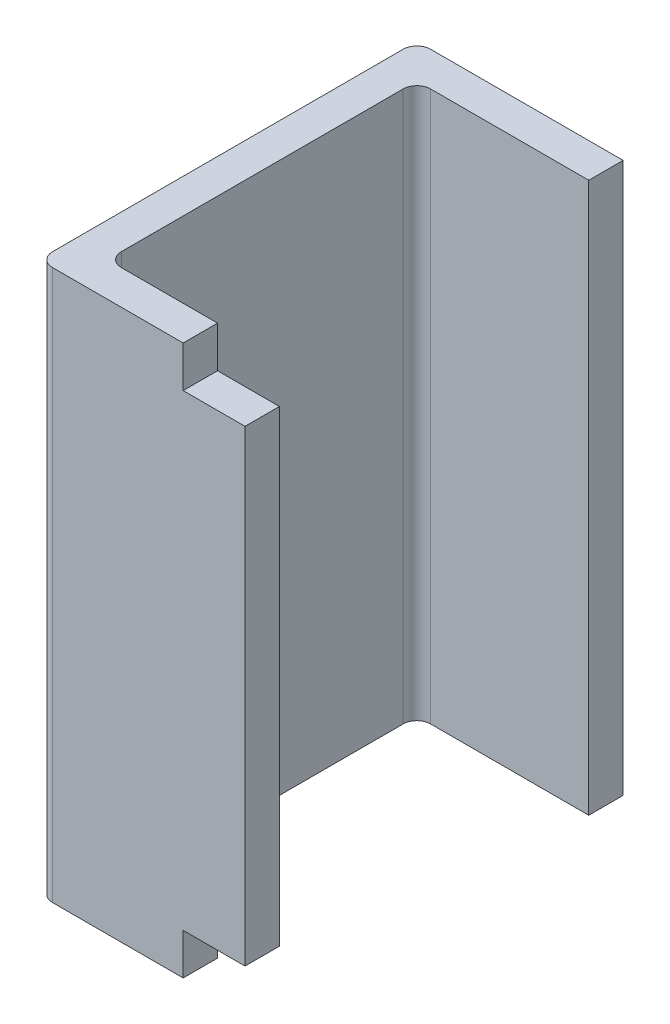
ISO-10303-21;
HEADER;
FILE_DESCRIPTION(('STEP AP214'),'2;1');
FILE_NAME('part.step','',(''),(''),'','','');
FILE_SCHEMA(('AUTOMOTIVE_DESIGN { 1 0 10303 214 1 1 1 1 }'));
ENDSEC;
DATA;
#1=APPLICATION_CONTEXT('core data for automotive mechanical design processes');
#2=APPLICATION_PROTOCOL_DEFINITION('international standard','automotive_design',2000,#1);
#3=PRODUCT_CONTEXT('',#1,'mechanical');
#4=PRODUCT('Part','Part','',(#3));
#5=PRODUCT_RELATED_PRODUCT_CATEGORY('part','',(#4));
#6=PRODUCT_DEFINITION_FORMATION('','',#4);
#7=PRODUCT_DEFINITION_CONTEXT('part definition',#1,'design');
#8=PRODUCT_DEFINITION('design','',#6,#7);
#9=PRODUCT_DEFINITION_SHAPE('','',#8);
#10=(LENGTH_UNIT() NAMED_UNIT(*) SI_UNIT(.MILLI.,.METRE.));
#11=(NAMED_UNIT(*) PLANE_ANGLE_UNIT() SI_UNIT($,.RADIAN.));
#12=(NAMED_UNIT(*) SI_UNIT($,.STERADIAN.) SOLID_ANGLE_UNIT());
#13=UNCERTAINTY_MEASURE_WITH_UNIT(LENGTH_MEASURE(1.E-05),#10,'distance_accuracy_value','');
#14=(GEOMETRIC_REPRESENTATION_CONTEXT(3) GLOBAL_UNCERTAINTY_ASSIGNED_CONTEXT((#13)) GLOBAL_UNIT_ASSIGNED_CONTEXT((#10,
#11,#12)) REPRESENTATION_CONTEXT('',''));
#15=CARTESIAN_POINT('',(0.,0.,0.));
#16=DIRECTION('',(0.,0.,1.));
#17=DIRECTION('',(1.,0.,0.));
#18=AXIS2_PLACEMENT_3D('',#15,#16,#17);
#19=CARTESIAN_POINT('',(-0.565,-0.34,0.55));
#20=DIRECTION('',(0.,1.,0.));
#21=DIRECTION('',(0.,0.,1.));
#22=AXIS2_PLACEMENT_3D('',#19,#20,#21);
#23=PLANE('',#22);
#24=DIRECTION('',(0.,0.,1.));
#25=VECTOR('',#24,1.);
#26=CARTESIAN_POINT('',(-0.475,-0.34,0.45));
#27=LINE('',#26,#25);
#28=CARTESIAN_POINT('',(-0.475,-0.34,0.5));
#29=VERTEX_POINT('',#28);
#30=CARTESIAN_POINT('',(-0.475,-0.34,0.55));
#31=VERTEX_POINT('',#30);
#32=EDGE_CURVE('E210',#29,#31,#27,.T.);
#33=ORIENTED_EDGE('',*,*,#32,.T.);
#34=DIRECTION('',(1.,0.,0.));
#35=VECTOR('',#34,1.);
#36=CARTESIAN_POINT('',(0.,-0.34,0.55));
#37=LINE('',#36,#35);
#38=CARTESIAN_POINT('',(-0.565,-0.34,0.55));
#39=VERTEX_POINT('',#38);
#40=EDGE_CURVE('E129',#39,#31,#37,.T.);
#41=ORIENTED_EDGE('',*,*,#40,.F.);
#42=DIRECTION('',(0.,0.,1.));
#43=VECTOR('',#42,1.);
#44=CARTESIAN_POINT('',(-0.565,-0.34,0.55));
#45=LINE('',#44,#43);
#46=CARTESIAN_POINT('',(-0.565,-0.34,0.5));
#47=VERTEX_POINT('',#46);
#48=EDGE_CURVE('E140',#39,#47,#45,.F.);
#49=ORIENTED_EDGE('',*,*,#48,.T.);
#50=DIRECTION('',(1.,0.,0.));
#51=VECTOR('',#50,1.);
#52=CARTESIAN_POINT('',(-0.725,-0.34,0.5));
#53=LINE('',#52,#51);
#54=EDGE_CURVE('E150',#47,#29,#53,.T.);
#55=ORIENTED_EDGE('',*,*,#54,.T.);
#56=EDGE_LOOP('',(#33,#41,#49,#55));
#57=FACE_BOUND('',#56,.T.);
#58=ADVANCED_FACE('F17',(#57),#23,.F.);
#59=CARTESIAN_POINT('',(-0.475,0.4,0.45));
#60=DIRECTION('',(-1.,0.,0.));
#61=DIRECTION('',(0.,0.,1.));
#62=AXIS2_PLACEMENT_3D('',#59,#60,#61);
#63=PLANE('',#62);
#64=DIRECTION('',(0.,1.,0.));
#65=VECTOR('',#64,1.);
#66=CARTESIAN_POINT('',(-0.475,0.4,0.5));
#67=LINE('',#66,#65);
#68=CARTESIAN_POINT('',(-0.475,0.34,0.5));
#69=VERTEX_POINT('',#68);
#70=EDGE_CURVE('E231',#29,#69,#67,.T.);
#71=ORIENTED_EDGE('',*,*,#70,.T.);
#72=DIRECTION('',(0.,0.,-1.));
#73=VECTOR('',#72,1.);
#74=CARTESIAN_POINT('',(-0.475,0.34,0.55));
#75=LINE('',#74,#73);
#76=CARTESIAN_POINT('',(-0.475,0.34,0.55));
#77=VERTEX_POINT('',#76);
#78=EDGE_CURVE('E200',#69,#77,#75,.F.);
#79=ORIENTED_EDGE('',*,*,#78,.T.);
#80=DIRECTION('',(0.,1.,0.));
#81=VECTOR('',#80,1.);
#82=CARTESIAN_POINT('',(-0.475,0.,0.55));
#83=LINE('',#82,#81);
#84=EDGE_CURVE('E205',#31,#77,#83,.T.);
#85=ORIENTED_EDGE('',*,*,#84,.F.);
#86=ORIENTED_EDGE('',*,*,#32,.F.);
#87=EDGE_LOOP('',(#71,#79,#85,#86));
#88=FACE_BOUND('',#87,.T.);
#89=ADVANCED_FACE('F342',(#88),#63,.F.);
#90=CARTESIAN_POINT('',(-0.475,0.34,0.55));
#91=DIRECTION('',(0.,-1.,0.));
#92=DIRECTION('',(0.,0.,-1.));
#93=AXIS2_PLACEMENT_3D('',#90,#91,#92);
#94=PLANE('',#93);
#95=DIRECTION('',(0.,0.,1.));
#96=VECTOR('',#95,1.);
#97=CARTESIAN_POINT('',(-0.565,0.34,0.55));
#98=LINE('',#97,#96);
#99=CARTESIAN_POINT('',(-0.565,0.34,0.5));
#100=VERTEX_POINT('',#99);
#101=CARTESIAN_POINT('',(-0.565,0.34,0.55));
#102=VERTEX_POINT('',#101);
#103=EDGE_CURVE('E172',#100,#102,#98,.T.);
#104=ORIENTED_EDGE('',*,*,#103,.T.);
#105=DIRECTION('',(1.,0.,0.));
#106=VECTOR('',#105,1.);
#107=CARTESIAN_POINT('',(0.,0.34,0.55));
#108=LINE('',#107,#106);
#109=EDGE_CURVE('E195',#77,#102,#108,.F.);
#110=ORIENTED_EDGE('',*,*,#109,.F.);
#111=ORIENTED_EDGE('',*,*,#78,.F.);
#112=DIRECTION('',(1.,0.,0.));
#113=VECTOR('',#112,1.);
#114=CARTESIAN_POINT('',(-0.725,0.34,0.5));
#115=LINE('',#114,#113);
#116=EDGE_CURVE('E186',#69,#100,#115,.F.);
#117=ORIENTED_EDGE('',*,*,#116,.T.);
#118=EDGE_LOOP('',(#104,#110,#111,#117));
#119=FACE_BOUND('',#118,.T.);
#120=ADVANCED_FACE('F348',(#119),#94,.F.);
#121=CARTESIAN_POINT('',(-0.565,0.34,0.55));
#122=DIRECTION('',(-1.,0.,0.));
#123=DIRECTION('',(0.,0.,1.));
#124=AXIS2_PLACEMENT_3D('',#121,#122,#123);
#125=PLANE('',#124);
#126=DIRECTION('',(0.,0.,1.));
#127=VECTOR('',#126,1.);
#128=CARTESIAN_POINT('',(-0.565,0.4,0.));
#129=LINE('',#128,#127);
#130=CARTESIAN_POINT('',(-0.565,0.4,0.55));
#131=VERTEX_POINT('',#130);
#132=CARTESIAN_POINT('',(-0.565,0.4,0.5));
#133=VERTEX_POINT('',#132);
#134=EDGE_CURVE('E120',#131,#133,#129,.F.);
#135=ORIENTED_EDGE('',*,*,#134,.F.);
#136=DIRECTION('',(0.,1.,0.));
#137=VECTOR('',#136,1.);
#138=CARTESIAN_POINT('',(-0.565,0.,0.55));
#139=LINE('',#138,#137);
#140=EDGE_CURVE('E179',#102,#131,#139,.T.);
#141=ORIENTED_EDGE('',*,*,#140,.F.);
#142=ORIENTED_EDGE('',*,*,#103,.F.);
#143=DIRECTION('',(0.,1.,0.));
#144=VECTOR('',#143,1.);
#145=CARTESIAN_POINT('',(-0.565,0.4,0.5));
#146=LINE('',#145,#144);
#147=EDGE_CURVE('E146',#100,#133,#146,.T.);
#148=ORIENTED_EDGE('',*,*,#147,.T.);
#149=EDGE_LOOP('',(#135,#141,#142,#148));
#150=FACE_BOUND('',#149,.T.);
#151=ADVANCED_FACE('F353',(#150),#125,.F.);
#152=CARTESIAN_POINT('',(0.,0.,0.));
#153=DIRECTION('',(0.,0.,1.));
#154=DIRECTION('',(1.,0.,0.));
#155=AXIS2_PLACEMENT_3D('',#152,#153,#154);
#156=PLANE('',#155);
#157=DIRECTION('',(1.,0.,0.));
#158=VECTOR('',#157,1.);
#159=CARTESIAN_POINT('',(0.775,0.4,0.));
#160=LINE('',#159,#158);
#161=CARTESIAN_POINT('',(-0.475,0.4,0.));
#162=VERTEX_POINT('',#161);
#163=CARTESIAN_POINT('',(-0.755,0.4,0.));
#164=VERTEX_POINT('',#163);
#165=EDGE_CURVE('E102',#162,#164,#160,.F.);
#166=ORIENTED_EDGE('',*,*,#165,.F.);
#167=DIRECTION('',(0.,1.,0.));
#168=VECTOR('',#167,1.);
#169=CARTESIAN_POINT('',(-0.475,0.4,0.));
#170=LINE('',#169,#168);
#171=CARTESIAN_POINT('',(-0.475,-0.4,0.));
#172=VERTEX_POINT('',#171);
#173=EDGE_CURVE('E160',#162,#172,#170,.F.);
#174=ORIENTED_EDGE('',*,*,#173,.T.);
#175=DIRECTION('',(1.,0.,0.));
#176=VECTOR('',#175,1.);
#177=CARTESIAN_POINT('',(-0.775,-0.4,0.));
#178=LINE('',#177,#176);
#179=CARTESIAN_POINT('',(-0.755,-0.4,0.));
#180=VERTEX_POINT('',#179);
#181=EDGE_CURVE('E167',#180,#172,#178,.T.);
#182=ORIENTED_EDGE('',*,*,#181,.F.);
#183=DIRECTION('',(0.,-1.,0.));
#184=VECTOR('',#183,1.);
#185=CARTESIAN_POINT('',(-0.755,0.2,0.));
#186=LINE('',#185,#184);
#187=EDGE_CURVE('E175',#164,#180,#186,.T.);
#188=ORIENTED_EDGE('',*,*,#187,.F.);
#189=EDGE_LOOP('',(#166,#174,#182,#188));
#190=FACE_BOUND('',#189,.T.);
#191=ADVANCED_FACE('F291',(#190),#156,.F.);
#192=CARTESIAN_POINT('',(-0.475,0.4,-0.03709742412571));
#193=DIRECTION('',(-1.,0.,0.));
#194=DIRECTION('',(0.,0.,1.));
#195=AXIS2_PLACEMENT_3D('',#192,#193,#194);
#196=PLANE('',#195);
#197=ORIENTED_EDGE('',*,*,#173,.F.);
#198=DIRECTION('',(0.,0.,1.));
#199=VECTOR('',#198,1.);
#200=CARTESIAN_POINT('',(-0.475,0.4,0.));
#201=LINE('',#200,#199);
#202=CARTESIAN_POINT('',(-0.475,0.4,0.05));
#203=VERTEX_POINT('',#202);
#204=EDGE_CURVE('E104',#203,#162,#201,.F.);
#205=ORIENTED_EDGE('',*,*,#204,.F.);
#206=DIRECTION('',(0.,1.,0.));
#207=VECTOR('',#206,1.);
#208=CARTESIAN_POINT('',(-0.475,0.4,0.05));
#209=LINE('',#208,#207);
#210=CARTESIAN_POINT('',(-0.475,-0.4,0.05));
#211=VERTEX_POINT('',#210);
#212=EDGE_CURVE('E157',#203,#211,#209,.F.);
#213=ORIENTED_EDGE('',*,*,#212,.T.);
#214=DIRECTION('',(0.,0.,-1.));
#215=VECTOR('',#214,1.);
#216=CARTESIAN_POINT('',(-0.475,-0.4,0.));
#217=LINE('',#216,#215);
#218=EDGE_CURVE('E163',#172,#211,#217,.F.);
#219=ORIENTED_EDGE('',*,*,#218,.F.);
#220=EDGE_LOOP('',(#197,#205,#213,#219));
#221=FACE_BOUND('',#220,.T.);
#222=ADVANCED_FACE('F284',(#221),#196,.F.);
#223=CARTESIAN_POINT('',(0.725,0.4,0.05));
#224=DIRECTION('',(0.,0.,-1.));
#225=DIRECTION('',(-1.,0.,0.));
#226=AXIS2_PLACEMENT_3D('',#223,#224,#225);
#227=PLANE('',#226);
#228=DIRECTION('',(1.,0.,0.));
#229=VECTOR('',#228,1.);
#230=CARTESIAN_POINT('',(-0.775,-0.4,0.05));
#231=LINE('',#230,#229);
#232=CARTESIAN_POINT('',(-0.705,-0.4,0.05));
#233=VERTEX_POINT('',#232);
#234=EDGE_CURVE('E166',#211,#233,#231,.F.);
#235=ORIENTED_EDGE('',*,*,#234,.F.);
#236=ORIENTED_EDGE('',*,*,#212,.F.);
#237=DIRECTION('',(1.,0.,0.));
#238=VECTOR('',#237,1.);
#239=CARTESIAN_POINT('',(0.775,0.4,0.05));
#240=LINE('',#239,#238);
#241=CARTESIAN_POINT('',(-0.705,0.4,0.05));
#242=VERTEX_POINT('',#241);
#243=EDGE_CURVE('E107',#242,#203,#240,.T.);
#244=ORIENTED_EDGE('',*,*,#243,.F.);
#245=DIRECTION('',(0.,1.,0.));
#246=VECTOR('',#245,1.);
#247=CARTESIAN_POINT('',(-0.705,0.4,0.05));
#248=LINE('',#247,#246);
#249=EDGE_CURVE('E154',#242,#233,#248,.F.);
#250=ORIENTED_EDGE('',*,*,#249,.T.);
#251=EDGE_LOOP('',(#235,#236,#244,#250));
#252=FACE_BOUND('',#251,.T.);
#253=ADVANCED_FACE('F277',(#252),#227,.F.);
#254=CARTESIAN_POINT('',(-0.705,0.4,0.07));
#255=DIRECTION('',(0.,1.,0.));
#256=DIRECTION('',(0.,0.,1.));
#257=AXIS2_PLACEMENT_3D('',#254,#255,#256);
#258=CYLINDRICAL_SURFACE('',#257,0.02);
#259=ORIENTED_EDGE('',*,*,#249,.F.);
#260=CARTESIAN_POINT('',(-0.705,0.4,0.07));
#261=DIRECTION('',(0.,1.,0.));
#262=DIRECTION('',(0.,0.,1.));
#263=AXIS2_PLACEMENT_3D('',#260,#261,#262);
#264=CIRCLE('',#263,0.02);
#265=CARTESIAN_POINT('',(-0.725,0.4,0.07));
#266=VERTEX_POINT('',#265);
#267=EDGE_CURVE('E110',#266,#242,#264,.F.);
#268=ORIENTED_EDGE('',*,*,#267,.F.);
#269=DIRECTION('',(0.,1.,0.));
#270=VECTOR('',#269,1.);
#271=CARTESIAN_POINT('',(-0.725,0.4,0.07));
#272=LINE('',#271,#270);
#273=CARTESIAN_POINT('',(-0.725,-0.4,0.07));
#274=VERTEX_POINT('',#273);
#275=EDGE_CURVE('E151',#266,#274,#272,.F.);
#276=ORIENTED_EDGE('',*,*,#275,.T.);
#277=CARTESIAN_POINT('',(-0.705,-0.4,0.07));
#278=DIRECTION('',(0.,1.,0.));
#279=DIRECTION('',(0.,0.,1.));
#280=AXIS2_PLACEMENT_3D('',#277,#278,#279);
#281=CIRCLE('',#280,0.02);
#282=EDGE_CURVE('E246',#233,#274,#281,.T.);
#283=ORIENTED_EDGE('',*,*,#282,.F.);
#284=EDGE_LOOP('',(#259,#268,#276,#283));
#285=FACE_BOUND('',#284,.T.);
#286=ADVANCED_FACE('F270',(#285),#258,.F.);
#287=CARTESIAN_POINT('',(-0.725,0.4,0.05));
#288=DIRECTION('',(-1.,0.,0.));
#289=DIRECTION('',(0.,0.,1.));
#290=AXIS2_PLACEMENT_3D('',#287,#288,#289);
#291=PLANE('',#290);
#292=DIRECTION('',(0.,0.,-1.));
#293=VECTOR('',#292,1.);
#294=CARTESIAN_POINT('',(-0.725,-0.4,0.));
#295=LINE('',#294,#293);
#296=CARTESIAN_POINT('',(-0.725,-0.4,0.48));
#297=VERTEX_POINT('',#296);
#298=EDGE_CURVE('E245',#274,#297,#295,.F.);
#299=ORIENTED_EDGE('',*,*,#298,.F.);
#300=ORIENTED_EDGE('',*,*,#275,.F.);
#301=DIRECTION('',(0.,0.,1.));
#302=VECTOR('',#301,1.);
#303=CARTESIAN_POINT('',(-0.725,0.4,0.));
#304=LINE('',#303,#302);
#305=CARTESIAN_POINT('',(-0.725,0.4,0.48));
#306=VERTEX_POINT('',#305);
#307=EDGE_CURVE('E113',#306,#266,#304,.F.);
#308=ORIENTED_EDGE('',*,*,#307,.F.);
#309=DIRECTION('',(0.,1.,0.));
#310=VECTOR('',#309,1.);
#311=CARTESIAN_POINT('',(-0.725,0.4,0.48));
#312=LINE('',#311,#310);
#313=EDGE_CURVE('E147',#306,#297,#312,.F.);
#314=ORIENTED_EDGE('',*,*,#313,.T.);
#315=EDGE_LOOP('',(#299,#300,#308,#314));
#316=FACE_BOUND('',#315,.T.);
#317=ADVANCED_FACE('F266',(#316),#291,.F.);
#318=CARTESIAN_POINT('',(-0.705,0.4,0.48));
#319=DIRECTION('',(0.,1.,0.));
#320=DIRECTION('',(0.,0.,1.));
#321=AXIS2_PLACEMENT_3D('',#318,#319,#320);
#322=CYLINDRICAL_SURFACE('',#321,0.02);
#323=ORIENTED_EDGE('',*,*,#313,.F.);
#324=CARTESIAN_POINT('',(-0.705,0.4,0.48));
#325=DIRECTION('',(0.,1.,0.));
#326=DIRECTION('',(0.,0.,1.));
#327=AXIS2_PLACEMENT_3D('',#324,#325,#326);
#328=CIRCLE('',#327,0.02);
#329=CARTESIAN_POINT('',(-0.705,0.4,0.5));
#330=VERTEX_POINT('',#329);
#331=EDGE_CURVE('E116',#330,#306,#328,.F.);
#332=ORIENTED_EDGE('',*,*,#331,.F.);
#333=DIRECTION('',(0.,1.,0.));
#334=VECTOR('',#333,1.);
#335=CARTESIAN_POINT('',(-0.705,0.4,0.5));
#336=LINE('',#335,#334);
#337=CARTESIAN_POINT('',(-0.705,-0.4,0.5));
#338=VERTEX_POINT('',#337);
#339=EDGE_CURVE('E143',#330,#338,#336,.F.);
#340=ORIENTED_EDGE('',*,*,#339,.T.);
#341=CARTESIAN_POINT('',(-0.705,-0.4,0.48));
#342=DIRECTION('',(0.,1.,0.));
#343=DIRECTION('',(0.,0.,1.));
#344=AXIS2_PLACEMENT_3D('',#341,#342,#343);
#345=CIRCLE('',#344,0.02);
#346=EDGE_CURVE('E242',#297,#338,#345,.T.);
#347=ORIENTED_EDGE('',*,*,#346,.F.);
#348=EDGE_LOOP('',(#323,#332,#340,#347));
#349=FACE_BOUND('',#348,.T.);
#350=ADVANCED_FACE('F258',(#349),#322,.F.);
#351=CARTESIAN_POINT('',(-0.725,0.4,0.5));
#352=DIRECTION('',(0.,0.,1.));
#353=DIRECTION('',(1.,0.,0.));
#354=AXIS2_PLACEMENT_3D('',#351,#352,#353);
#355=PLANE('',#354);
#356=DIRECTION('',(1.,0.,0.));
#357=VECTOR('',#356,1.);
#358=CARTESIAN_POINT('',(0.775,0.4,0.5));
#359=LINE('',#358,#357);
#360=EDGE_CURVE('E117',#133,#330,#359,.F.);
#361=ORIENTED_EDGE('',*,*,#360,.F.);
#362=ORIENTED_EDGE('',*,*,#147,.F.);
#363=ORIENTED_EDGE('',*,*,#116,.F.);
#364=ORIENTED_EDGE('',*,*,#70,.F.);
#365=ORIENTED_EDGE('',*,*,#54,.F.);
#366=DIRECTION('',(0.,1.,0.));
#367=VECTOR('',#366,1.);
#368=CARTESIAN_POINT('',(-0.565,-0.4,0.5));
#369=LINE('',#368,#367);
#370=CARTESIAN_POINT('',(-0.565,-0.4,0.5));
#371=VERTEX_POINT('',#370);
#372=EDGE_CURVE('E130',#47,#371,#369,.F.);
#373=ORIENTED_EDGE('',*,*,#372,.T.);
#374=DIRECTION('',(1.,0.,0.));
#375=VECTOR('',#374,1.);
#376=CARTESIAN_POINT('',(-0.775,-0.4,0.5));
#377=LINE('',#376,#375);
#378=EDGE_CURVE('E135',#338,#371,#377,.T.);
#379=ORIENTED_EDGE('',*,*,#378,.F.);
#380=ORIENTED_EDGE('',*,*,#339,.F.);
#381=EDGE_LOOP('',(#361,#362,#363,#364,#365,#373,#379,#380));
#382=FACE_BOUND('',#381,.T.);
#383=ADVANCED_FACE('F312',(#382),#355,.F.);
#384=CARTESIAN_POINT('',(-0.565,-0.4,0.55));
#385=DIRECTION('',(-1.,0.,0.));
#386=DIRECTION('',(0.,0.,1.));
#387=AXIS2_PLACEMENT_3D('',#384,#385,#386);
#388=PLANE('',#387);
#389=ORIENTED_EDGE('',*,*,#48,.F.);
#390=DIRECTION('',(0.,1.,0.));
#391=VECTOR('',#390,1.);
#392=CARTESIAN_POINT('',(-0.565,0.,0.55));
#393=LINE('',#392,#391);
#394=CARTESIAN_POINT('',(-0.565,-0.4,0.55));
#395=VERTEX_POINT('',#394);
#396=EDGE_CURVE('E126',#395,#39,#393,.T.);
#397=ORIENTED_EDGE('',*,*,#396,.F.);
#398=DIRECTION('',(0.,0.,-1.));
#399=VECTOR('',#398,1.);
#400=CARTESIAN_POINT('',(-0.565,-0.4,0.));
#401=LINE('',#400,#399);
#402=EDGE_CURVE('E98',#371,#395,#401,.F.);
#403=ORIENTED_EDGE('',*,*,#402,.F.);
#404=ORIENTED_EDGE('',*,*,#372,.F.);
#405=EDGE_LOOP('',(#389,#397,#403,#404));
#406=FACE_BOUND('',#405,.T.);
#407=ADVANCED_FACE('F363',(#406),#388,.F.);
#408=CARTESIAN_POINT('',(0.,0.,0.55));
#409=DIRECTION('',(0.,0.,1.));
#410=DIRECTION('',(1.,0.,0.));
#411=AXIS2_PLACEMENT_3D('',#408,#409,#410);
#412=PLANE('',#411);
#413=ORIENTED_EDGE('',*,*,#140,.T.);
#414=DIRECTION('',(1.,0.,0.));
#415=VECTOR('',#414,1.);
#416=CARTESIAN_POINT('',(0.775,0.4,0.55));
#417=LINE('',#416,#415);
#418=CARTESIAN_POINT('',(-0.755,0.4,0.55));
#419=VERTEX_POINT('',#418);
#420=EDGE_CURVE('E85',#419,#131,#417,.T.);
#421=ORIENTED_EDGE('',*,*,#420,.F.);
#422=DIRECTION('',(0.,-1.,0.));
#423=VECTOR('',#422,1.);
#424=CARTESIAN_POINT('',(-0.755,0.2,0.55));
#425=LINE('',#424,#423);
#426=CARTESIAN_POINT('',(-0.755,-0.4,0.55));
#427=VERTEX_POINT('',#426);
#428=EDGE_CURVE('E81',#427,#419,#425,.F.);
#429=ORIENTED_EDGE('',*,*,#428,.F.);
#430=DIRECTION('',(1.,0.,0.));
#431=VECTOR('',#430,1.);
#432=CARTESIAN_POINT('',(-0.775,-0.4,0.55));
#433=LINE('',#432,#431);
#434=EDGE_CURVE('E95',#395,#427,#433,.F.);
#435=ORIENTED_EDGE('',*,*,#434,.F.);
#436=ORIENTED_EDGE('',*,*,#396,.T.);
#437=ORIENTED_EDGE('',*,*,#40,.T.);
#438=ORIENTED_EDGE('',*,*,#84,.T.);
#439=ORIENTED_EDGE('',*,*,#109,.T.);
#440=EDGE_LOOP('',(#413,#421,#429,#435,#436,#437,#438,#439));
#441=FACE_BOUND('',#440,.T.);
#442=ADVANCED_FACE('F356',(#441),#412,.T.);
#443=CARTESIAN_POINT('',(-0.755,0.2,0.53));
#444=DIRECTION('',(0.,-1.,0.));
#445=DIRECTION('',(0.,0.,-1.));
#446=AXIS2_PLACEMENT_3D('',#443,#444,#445);
#447=CYLINDRICAL_SURFACE('',#446,0.02);
#448=CARTESIAN_POINT('',(-0.755,0.4,0.53));
#449=DIRECTION('',(0.,-1.,0.));
#450=DIRECTION('',(0.,0.,-1.));
#451=AXIS2_PLACEMENT_3D('',#448,#449,#450);
#452=CIRCLE('',#451,0.02);
#453=CARTESIAN_POINT('',(-0.775,0.4,0.53));
#454=VERTEX_POINT('',#453);
#455=EDGE_CURVE('E20',#454,#419,#452,.F.);
#456=ORIENTED_EDGE('',*,*,#455,.F.);
#457=DIRECTION('',(0.,1.,0.));
#458=VECTOR('',#457,1.);
#459=CARTESIAN_POINT('',(-0.775,0.4,0.53));
#460=LINE('',#459,#458);
#461=CARTESIAN_POINT('',(-0.775,-0.4,0.53));
#462=VERTEX_POINT('',#461);
#463=EDGE_CURVE('E79',#462,#454,#460,.T.);
#464=ORIENTED_EDGE('',*,*,#463,.F.);
#465=CARTESIAN_POINT('',(-0.755,-0.4,0.53));
#466=DIRECTION('',(0.,-1.,0.));
#467=DIRECTION('',(0.,0.,-1.));
#468=AXIS2_PLACEMENT_3D('',#465,#466,#467);
#469=CIRCLE('',#468,0.02);
#470=EDGE_CURVE('E177',#427,#462,#469,.T.);
#471=ORIENTED_EDGE('',*,*,#470,.F.);
#472=ORIENTED_EDGE('',*,*,#428,.T.);
#473=EDGE_LOOP('',(#456,#464,#471,#472));
#474=FACE_BOUND('',#473,.T.);
#475=ADVANCED_FACE('F76',(#474),#447,.T.);
#476=CARTESIAN_POINT('',(0.775,0.4,0.));
#477=DIRECTION('',(0.,1.,0.));
#478=DIRECTION('',(0.,0.,1.));
#479=AXIS2_PLACEMENT_3D('',#476,#477,#478);
#480=PLANE('',#479);
#481=CARTESIAN_POINT('',(-0.755,0.4,0.02));
#482=DIRECTION('',(0.,-1.,0.));
#483=DIRECTION('',(0.,0.,-1.));
#484=AXIS2_PLACEMENT_3D('',#481,#482,#483);
#485=CIRCLE('',#484,0.02);
#486=CARTESIAN_POINT('',(-0.775,0.4,0.02));
#487=VERTEX_POINT('',#486);
#488=EDGE_CURVE('E90',#487,#164,#485,.T.);
#489=ORIENTED_EDGE('',*,*,#488,.F.);
#490=DIRECTION('',(0.,0.,1.));
#491=VECTOR('',#490,1.);
#492=CARTESIAN_POINT('',(-0.775,0.4,0.));
#493=LINE('',#492,#491);
#494=EDGE_CURVE('E87',#454,#487,#493,.F.);
#495=ORIENTED_EDGE('',*,*,#494,.F.);
#496=ORIENTED_EDGE('',*,*,#455,.T.);
#497=ORIENTED_EDGE('',*,*,#420,.T.);
#498=ORIENTED_EDGE('',*,*,#134,.T.);
#499=ORIENTED_EDGE('',*,*,#360,.T.);
#500=ORIENTED_EDGE('',*,*,#331,.T.);
#501=ORIENTED_EDGE('',*,*,#307,.T.);
#502=ORIENTED_EDGE('',*,*,#267,.T.);
#503=ORIENTED_EDGE('',*,*,#243,.T.);
#504=ORIENTED_EDGE('',*,*,#204,.T.);
#505=ORIENTED_EDGE('',*,*,#165,.T.);
#506=EDGE_LOOP('',(#489,#495,#496,#497,#498,#499,#500,#501,#502,#503,#504,#505));
#507=FACE_BOUND('',#506,.T.);
#508=ADVANCED_FACE('F88',(#507),#480,.T.);
#509=CARTESIAN_POINT('',(-0.755,0.2,0.02));
#510=DIRECTION('',(0.,-1.,0.));
#511=DIRECTION('',(0.,0.,-1.));
#512=AXIS2_PLACEMENT_3D('',#509,#510,#511);
#513=CYLINDRICAL_SURFACE('',#512,0.02);
#514=ORIENTED_EDGE('',*,*,#488,.T.);
#515=ORIENTED_EDGE('',*,*,#187,.T.);
#516=CARTESIAN_POINT('',(-0.755,-0.4,0.02));
#517=DIRECTION('',(0.,-1.,0.));
#518=DIRECTION('',(0.,0.,-1.));
#519=AXIS2_PLACEMENT_3D('',#516,#517,#518);
#520=CIRCLE('',#519,0.02);
#521=CARTESIAN_POINT('',(-0.775,-0.4,0.02));
#522=VERTEX_POINT('',#521);
#523=EDGE_CURVE('E35',#522,#180,#520,.T.);
#524=ORIENTED_EDGE('',*,*,#523,.F.);
#525=DIRECTION('',(0.,1.,0.));
#526=VECTOR('',#525,1.);
#527=CARTESIAN_POINT('',(-0.775,0.4,0.02));
#528=LINE('',#527,#526);
#529=EDGE_CURVE('E26',#487,#522,#528,.F.);
#530=ORIENTED_EDGE('',*,*,#529,.F.);
#531=EDGE_LOOP('',(#514,#515,#524,#530));
#532=FACE_BOUND('',#531,.T.);
#533=ADVANCED_FACE('F292',(#532),#513,.T.);
#534=CARTESIAN_POINT('',(-0.775,-0.4,0.));
#535=DIRECTION('',(0.,-1.,0.));
#536=DIRECTION('',(0.,0.,-1.));
#537=AXIS2_PLACEMENT_3D('',#534,#535,#536);
#538=PLANE('',#537);
#539=ORIENTED_EDGE('',*,*,#402,.T.);
#540=ORIENTED_EDGE('',*,*,#434,.T.);
#541=ORIENTED_EDGE('',*,*,#470,.T.);
#542=DIRECTION('',(0.,0.,1.));
#543=VECTOR('',#542,1.);
#544=CARTESIAN_POINT('',(-0.775,-0.4,0.));
#545=LINE('',#544,#543);
#546=EDGE_CURVE('E11',#522,#462,#545,.T.);
#547=ORIENTED_EDGE('',*,*,#546,.F.);
#548=ORIENTED_EDGE('',*,*,#523,.T.);
#549=ORIENTED_EDGE('',*,*,#181,.T.);
#550=ORIENTED_EDGE('',*,*,#218,.T.);
#551=ORIENTED_EDGE('',*,*,#234,.T.);
#552=ORIENTED_EDGE('',*,*,#282,.T.);
#553=ORIENTED_EDGE('',*,*,#298,.T.);
#554=ORIENTED_EDGE('',*,*,#346,.T.);
#555=ORIENTED_EDGE('',*,*,#378,.T.);
#556=EDGE_LOOP('',(#539,#540,#541,#547,#548,#549,#550,#551,#552,#553,#554,#555));
#557=FACE_BOUND('',#556,.T.);
#558=ADVANCED_FACE('F308',(#557),#538,.T.);
#559=CARTESIAN_POINT('',(-0.775,0.4,0.));
#560=DIRECTION('',(-1.,0.,0.));
#561=DIRECTION('',(0.,0.,1.));
#562=AXIS2_PLACEMENT_3D('',#559,#560,#561);
#563=PLANE('',#562);
#564=ORIENTED_EDGE('',*,*,#529,.T.);
#565=ORIENTED_EDGE('',*,*,#546,.T.);
#566=ORIENTED_EDGE('',*,*,#463,.T.);
#567=ORIENTED_EDGE('',*,*,#494,.T.);
#568=EDGE_LOOP('',(#564,#565,#566,#567));
#569=FACE_BOUND('',#568,.T.);
#570=ADVANCED_FACE('F94',(#569),#563,.T.);
#571=CLOSED_SHELL('',(#58,#89,#120,#151,#191,#222,#253,#286,#317,#350,#383,#407,#442,#475,#508,
#533,#558,#570));
#572=MANIFOLD_SOLID_BREP('B1',#571);
#573=ADVANCED_BREP_SHAPE_REPRESENTATION('',(#18,#572),#14);
#574=SHAPE_DEFINITION_REPRESENTATION(#9,#573);
ENDSEC;
END-ISO-10303-21;
